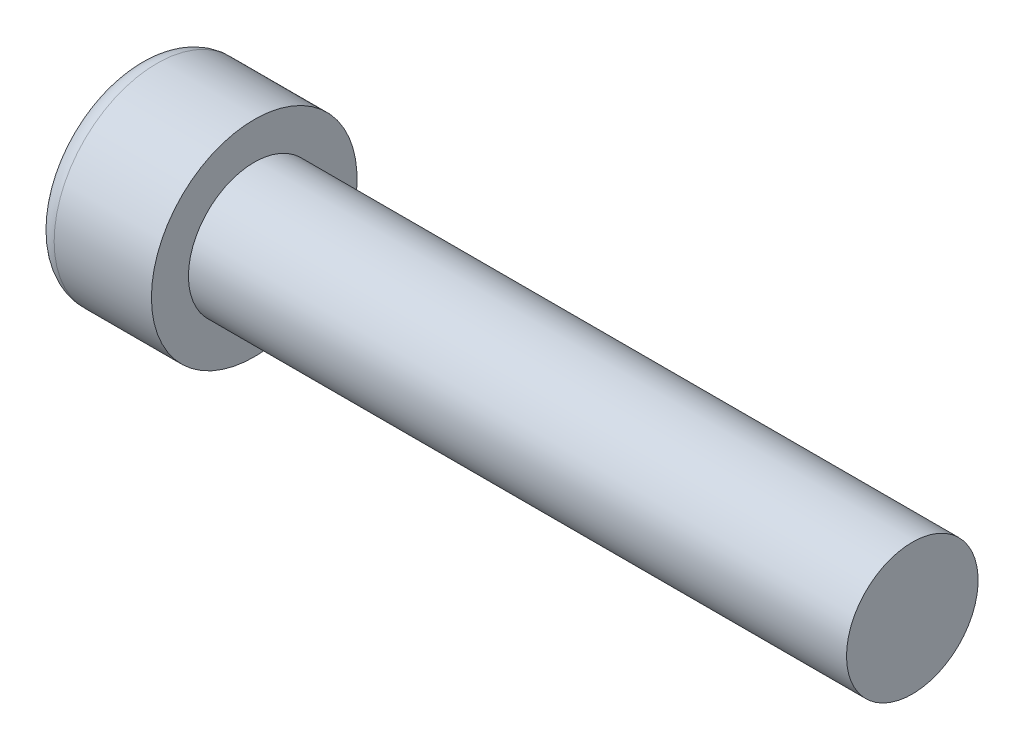
ISO-10303-21;
HEADER;
FILE_DESCRIPTION(('STEP AP214'),'2;1');
FILE_NAME('part.step','',(''),(''),'','','');
FILE_SCHEMA(('AUTOMOTIVE_DESIGN { 1 0 10303 214 1 1 1 1 }'));
ENDSEC;
DATA;
#1=APPLICATION_CONTEXT('core data for automotive mechanical design processes');
#2=APPLICATION_PROTOCOL_DEFINITION('international standard','automotive_design',2000,#1);
#3=PRODUCT_CONTEXT('',#1,'mechanical');
#4=PRODUCT('Part','Part','',(#3));
#5=PRODUCT_RELATED_PRODUCT_CATEGORY('part','',(#4));
#6=PRODUCT_DEFINITION_FORMATION('','',#4);
#7=PRODUCT_DEFINITION_CONTEXT('part definition',#1,'design');
#8=PRODUCT_DEFINITION('design','',#6,#7);
#9=PRODUCT_DEFINITION_SHAPE('','',#8);
#10=(LENGTH_UNIT() NAMED_UNIT(*) SI_UNIT(.MILLI.,.METRE.));
#11=(NAMED_UNIT(*) PLANE_ANGLE_UNIT() SI_UNIT($,.RADIAN.));
#12=(NAMED_UNIT(*) SI_UNIT($,.STERADIAN.) SOLID_ANGLE_UNIT());
#13=UNCERTAINTY_MEASURE_WITH_UNIT(LENGTH_MEASURE(1.E-05),#10,'distance_accuracy_value','');
#14=(GEOMETRIC_REPRESENTATION_CONTEXT(3) GLOBAL_UNCERTAINTY_ASSIGNED_CONTEXT((#13)) GLOBAL_UNIT_ASSIGNED_CONTEXT((#10,
#11,#12)) REPRESENTATION_CONTEXT('',''));
#15=CARTESIAN_POINT('',(0.,0.,0.));
#16=DIRECTION('',(0.,0.,1.));
#17=DIRECTION('',(1.,0.,0.));
#18=AXIS2_PLACEMENT_3D('',#15,#16,#17);
#19=CARTESIAN_POINT('',(3.2,0.,0.));
#20=DIRECTION('',(-1.,0.,0.));
#21=DIRECTION('',(0.,1.,0.));
#22=AXIS2_PLACEMENT_3D('',#19,#20,#21);
#23=SPHERICAL_SURFACE('',#22,3.2);
#24=CARTESIAN_POINT('',(0.192048521598005,0.,0.));
#25=DIRECTION('',(-1.,0.,0.));
#26=DIRECTION('',(0.,0.,1.));
#27=AXIS2_PLACEMENT_3D('',#24,#25,#26);
#28=CIRCLE('',#27,1.09189189189189);
#29=CARTESIAN_POINT('',(0.192048521598005,0.,1.09189189189189));
#30=VERTEX_POINT('',#29);
#31=EDGE_CURVE('E154',#30,#30,#28,.T.);
#32=ORIENTED_EDGE('',*,*,#31,.T.);
#33=EDGE_LOOP('',(#32));
#34=FACE_BOUND('',#33,.T.);
#35=CARTESIAN_POINT('',(3.19174554351625,-0.0818566934638239,0.));
#36=DIRECTION('',(-0.100331502261418,-0.994954064092392,0.));
#37=DIRECTION('',(0.994954064092392,-0.100331502261418,0.));
#38=AXIS2_PLACEMENT_3D('',#35,#36,#37);
#39=CIRCLE('',#38,3.1989422229361);
#40=CARTESIAN_POINT('',(0.118330716626357,0.228067490760365,0.83144431417242));
#41=VERTEX_POINT('',#40);
#42=CARTESIAN_POINT('',(0.0177814447975956,0.238206913129653,0.238206913129654));
#43=VERTEX_POINT('',#42);
#44=EDGE_CURVE('E185',#41,#43,#39,.T.);
#45=ORIENTED_EDGE('',*,*,#44,.F.);
#46=CARTESIAN_POINT('',(2.64043280070581,0.,-0.842892363493775));
#47=DIRECTION('',(0.553083521918191,0.,0.833125811497021));
#48=DIRECTION('',(0.833125811497021,0.,-0.553083521918191));
#49=AXIS2_PLACEMENT_3D('',#46,#47,#48);
#50=CIRCLE('',#49,3.03585523585001);
#51=CARTESIAN_POINT('',(0.118330716626356,-0.22806749076037,0.831444314172418));
#52=VERTEX_POINT('',#51);
#53=EDGE_CURVE('E150',#41,#52,#50,.T.);
#54=ORIENTED_EDGE('',*,*,#53,.T.);
#55=CARTESIAN_POINT('',(3.19174554351625,0.0818566934638237,0.));
#56=DIRECTION('',(-0.100331502261418,0.994954064092392,0.));
#57=DIRECTION('',(-0.994954064092392,-0.100331502261418,0.));
#58=AXIS2_PLACEMENT_3D('',#55,#56,#57);
#59=CIRCLE('',#58,3.1989422229361);
#60=CARTESIAN_POINT('',(0.0177814447975947,-0.238206913129655,0.238206913129654));
#61=VERTEX_POINT('',#60);
#62=EDGE_CURVE('E106',#61,#52,#59,.T.);
#63=ORIENTED_EDGE('',*,*,#62,.F.);
#64=CARTESIAN_POINT('',(3.19174554351625,0.,-0.0818566934638237));
#65=DIRECTION('',(-0.100331502261418,0.,-0.994954064092392));
#66=DIRECTION('',(-0.994954064092392,0.,0.100331502261418));
#67=AXIS2_PLACEMENT_3D('',#64,#65,#66);
#68=CIRCLE('',#67,3.1989422229361);
#69=CARTESIAN_POINT('',(0.118330716626357,-0.831444314172419,0.228067490760367));
#70=VERTEX_POINT('',#69);
#71=EDGE_CURVE('E131',#70,#61,#68,.T.);
#72=ORIENTED_EDGE('',*,*,#71,.F.);
#73=CARTESIAN_POINT('',(2.64043280070581,0.842892363493775,0.));
#74=DIRECTION('',(0.553083521918191,-0.833125811497021,0.));
#75=DIRECTION('',(0.833125811497021,0.553083521918191,0.));
#76=AXIS2_PLACEMENT_3D('',#73,#74,#75);
#77=CIRCLE('',#76,3.03585523585001);
#78=CARTESIAN_POINT('',(0.118330716626356,-0.831444314172419,-0.228067490760367));
#79=VERTEX_POINT('',#78);
#80=EDGE_CURVE('E139',#70,#79,#77,.T.);
#81=ORIENTED_EDGE('',*,*,#80,.T.);
#82=CARTESIAN_POINT('',(3.19174554351625,0.,0.0818566934638239));
#83=DIRECTION('',(-0.100331502261418,0.,0.994954064092392));
#84=DIRECTION('',(0.994954064092392,0.,0.100331502261418));
#85=AXIS2_PLACEMENT_3D('',#82,#83,#84);
#86=CIRCLE('',#85,3.1989422229361);
#87=CARTESIAN_POINT('',(0.0177814447975952,-0.238206913129653,-0.238206913129654));
#88=VERTEX_POINT('',#87);
#89=EDGE_CURVE('E49',#88,#79,#86,.T.);
#90=ORIENTED_EDGE('',*,*,#89,.F.);
#91=CARTESIAN_POINT('',(0.118330716626357,-0.228067490760364,-0.83144431417242));
#92=VERTEX_POINT('',#91);
#93=EDGE_CURVE('E192',#92,#88,#59,.T.);
#94=ORIENTED_EDGE('',*,*,#93,.F.);
#95=CARTESIAN_POINT('',(2.64043280070581,0.,0.842892363493775));
#96=DIRECTION('',(0.553083521918191,0.,-0.833125811497021));
#97=DIRECTION('',(-0.833125811497021,0.,-0.553083521918191));
#98=AXIS2_PLACEMENT_3D('',#95,#96,#97);
#99=CIRCLE('',#98,3.03585523585001);
#100=CARTESIAN_POINT('',(0.118330716626357,0.22806749076037,-0.831444314172418));
#101=VERTEX_POINT('',#100);
#102=EDGE_CURVE('E132',#92,#101,#99,.T.);
#103=ORIENTED_EDGE('',*,*,#102,.T.);
#104=CARTESIAN_POINT('',(0.0177814447975956,0.238206913129655,-0.238206913129654));
#105=VERTEX_POINT('',#104);
#106=EDGE_CURVE('E180',#105,#101,#39,.T.);
#107=ORIENTED_EDGE('',*,*,#106,.F.);
#108=CARTESIAN_POINT('',(0.118330716626356,0.831444314172419,-0.228067490760367));
#109=VERTEX_POINT('',#108);
#110=EDGE_CURVE('E42',#109,#105,#86,.T.);
#111=ORIENTED_EDGE('',*,*,#110,.F.);
#112=CARTESIAN_POINT('',(2.64043280070581,-0.842892363493776,0.));
#113=DIRECTION('',(0.553083521918191,0.833125811497021,0.));
#114=DIRECTION('',(-0.833125811497021,0.553083521918191,0.));
#115=AXIS2_PLACEMENT_3D('',#112,#113,#114);
#116=CIRCLE('',#115,3.03585523585001);
#117=CARTESIAN_POINT('',(0.118330716626357,0.831444314172419,0.228067490760367));
#118=VERTEX_POINT('',#117);
#119=EDGE_CURVE('E11',#109,#118,#116,.T.);
#120=ORIENTED_EDGE('',*,*,#119,.T.);
#121=EDGE_CURVE('E168',#43,#118,#68,.T.);
#122=ORIENTED_EDGE('',*,*,#121,.F.);
#123=EDGE_LOOP('',(#45,#54,#63,#72,#81,#90,#94,#103,#107,#111,#120,#122));
#124=FACE_BOUND('',#123,.T.);
#125=ADVANCED_FACE('F34',(#34,#124),#23,.T.);
#126=CARTESIAN_POINT('',(1.37075949367089,0.,-0.101772151898734));
#127=DIRECTION('',(-0.100331502261418,0.,0.994954064092392));
#128=DIRECTION('',(0.994954064092392,0.,0.100331502261418));
#129=AXIS2_PLACEMENT_3D('',#126,#127,#128);
#130=PLANE('',#129);
#131=ORIENTED_EDGE('',*,*,#110,.T.);
#132=DIRECTION('',(0.989983749746913,-0.0998302940921261,0.0998302940921257));
#133=VECTOR('',#132,1.);
#134=CARTESIAN_POINT('',(1.38081767298512,0.100757881715786,-0.100757881715786));
#135=LINE('',#134,#133);
#136=CARTESIAN_POINT('',(1.19,0.12,-0.12));
#137=VERTEX_POINT('',#136);
#138=EDGE_CURVE('E174',#105,#137,#135,.T.);
#139=ORIENTED_EDGE('',*,*,#138,.T.);
#140=DIRECTION('',(0.830201128729582,-0.551141925795269,0.083717760880294));
#141=VECTOR('',#140,1.);
#142=CARTESIAN_POINT('',(0.,0.91,-0.24));
#143=LINE('',#142,#141);
#144=EDGE_CURVE('E155',#109,#137,#143,.T.);
#145=ORIENTED_EDGE('',*,*,#144,.F.);
#146=EDGE_LOOP('',(#131,#139,#145));
#147=FACE_BOUND('',#146,.T.);
#148=ADVANCED_FACE('F173',(#147),#130,.T.);
#149=DIRECTION('',(0.830201128729582,0.551141925795269,0.083717760880294));
#150=VECTOR('',#149,1.);
#151=CARTESIAN_POINT('',(0.,-0.91,-0.24));
#152=LINE('',#151,#150);
#153=CARTESIAN_POINT('',(1.19,-0.12,-0.12));
#154=VERTEX_POINT('',#153);
#155=EDGE_CURVE('E140',#79,#154,#152,.T.);
#156=ORIENTED_EDGE('',*,*,#155,.T.);
#157=DIRECTION('',(-0.989983749746913,-0.0998302940921253,-0.0998302940921257));
#158=VECTOR('',#157,1.);
#159=CARTESIAN_POINT('',(1.38081767298512,-0.100757881715786,-0.100757881715786));
#160=LINE('',#159,#158);
#161=EDGE_CURVE('E195',#154,#88,#160,.T.);
#162=ORIENTED_EDGE('',*,*,#161,.T.);
#163=ORIENTED_EDGE('',*,*,#89,.T.);
#164=EDGE_LOOP('',(#156,#162,#163));
#165=FACE_BOUND('',#164,.T.);
#166=ADVANCED_FACE('F210',(#165),#130,.T.);
#167=CARTESIAN_POINT('',(1.37075949367089,0.,0.101772151898734));
#168=DIRECTION('',(-0.100331502261418,0.,-0.994954064092392));
#169=DIRECTION('',(-0.994954064092392,0.,0.100331502261418));
#170=AXIS2_PLACEMENT_3D('',#167,#168,#169);
#171=PLANE('',#170);
#172=DIRECTION('',(0.830201128729582,-0.551141925795269,-0.083717760880294));
#173=VECTOR('',#172,1.);
#174=CARTESIAN_POINT('',(0.,0.91,0.24));
#175=LINE('',#174,#173);
#176=CARTESIAN_POINT('',(1.19,0.12,0.12));
#177=VERTEX_POINT('',#176);
#178=EDGE_CURVE('E211',#118,#177,#175,.T.);
#179=ORIENTED_EDGE('',*,*,#178,.T.);
#180=DIRECTION('',(-0.989983749746913,0.0998302940921254,0.0998302940921256));
#181=VECTOR('',#180,1.);
#182=CARTESIAN_POINT('',(1.38081767298512,0.100757881715786,0.100757881715786));
#183=LINE('',#182,#181);
#184=EDGE_CURVE('E189',#177,#43,#183,.T.);
#185=ORIENTED_EDGE('',*,*,#184,.T.);
#186=ORIENTED_EDGE('',*,*,#121,.T.);
#187=EDGE_LOOP('',(#179,#185,#186));
#188=FACE_BOUND('',#187,.T.);
#189=ADVANCED_FACE('F215',(#188),#171,.T.);
#190=ORIENTED_EDGE('',*,*,#71,.T.);
#191=DIRECTION('',(0.989983749746913,0.099830294092126,-0.0998302940921256));
#192=VECTOR('',#191,1.);
#193=CARTESIAN_POINT('',(1.38081767298512,-0.100757881715786,0.100757881715786));
#194=LINE('',#193,#192);
#195=CARTESIAN_POINT('',(1.19,-0.12,0.12));
#196=VERTEX_POINT('',#195);
#197=EDGE_CURVE('E104',#61,#196,#194,.T.);
#198=ORIENTED_EDGE('',*,*,#197,.T.);
#199=DIRECTION('',(0.830201128729582,0.551141925795269,-0.0837177608802938));
#200=VECTOR('',#199,1.);
#201=CARTESIAN_POINT('',(0.,-0.91,0.24));
#202=LINE('',#201,#200);
#203=EDGE_CURVE('E129',#70,#196,#202,.T.);
#204=ORIENTED_EDGE('',*,*,#203,.F.);
#205=EDGE_LOOP('',(#190,#198,#204));
#206=FACE_BOUND('',#205,.T.);
#207=ADVANCED_FACE('F128',(#206),#171,.T.);
#208=CARTESIAN_POINT('',(-25.4,0.,0.));
#209=DIRECTION('',(-1.,0.,0.));
#210=DIRECTION('',(0.,0.,1.));
#211=AXIS2_PLACEMENT_3D('',#208,#209,#210);
#212=CYLINDRICAL_SURFACE('',#211,0.8);
#213=CARTESIAN_POINT('',(9.6,0.,0.));
#214=DIRECTION('',(-1.,0.,0.));
#215=DIRECTION('',(0.,0.,1.));
#216=AXIS2_PLACEMENT_3D('',#213,#214,#215);
#217=CIRCLE('',#216,0.8);
#218=CARTESIAN_POINT('',(9.6,0.,0.8));
#219=VERTEX_POINT('',#218);
#220=EDGE_CURVE('E151',#219,#219,#217,.T.);
#221=ORIENTED_EDGE('',*,*,#220,.T.);
#222=EDGE_LOOP('',(#221));
#223=FACE_BOUND('',#222,.T.);
#224=CARTESIAN_POINT('',(1.6,0.,0.));
#225=DIRECTION('',(-1.,0.,0.));
#226=DIRECTION('',(0.,0.,1.));
#227=AXIS2_PLACEMENT_3D('',#224,#225,#226);
#228=CIRCLE('',#227,0.8);
#229=CARTESIAN_POINT('',(1.6,0.,0.8));
#230=VERTEX_POINT('',#229);
#231=EDGE_CURVE('E164',#230,#230,#228,.T.);
#232=ORIENTED_EDGE('',*,*,#231,.F.);
#233=EDGE_LOOP('',(#232));
#234=FACE_BOUND('',#233,.T.);
#235=ADVANCED_FACE('F36',(#223,#234),#212,.T.);
#236=CARTESIAN_POINT('',(1.6,0.8,0.));
#237=DIRECTION('',(-1.,0.,0.));
#238=DIRECTION('',(0.,0.,1.));
#239=AXIS2_PLACEMENT_3D('',#236,#237,#238);
#240=PLANE('',#239);
#241=CARTESIAN_POINT('',(1.6,0.,0.));
#242=DIRECTION('',(-1.,0.,0.));
#243=DIRECTION('',(0.,0.,1.));
#244=AXIS2_PLACEMENT_3D('',#241,#242,#243);
#245=CIRCLE('',#244,1.25);
#246=CARTESIAN_POINT('',(1.6,0.,1.25));
#247=VERTEX_POINT('',#246);
#248=EDGE_CURVE('E161',#247,#247,#245,.T.);
#249=ORIENTED_EDGE('',*,*,#248,.F.);
#250=EDGE_LOOP('',(#249));
#251=FACE_BOUND('',#250,.T.);
#252=ORIENTED_EDGE('',*,*,#231,.T.);
#253=EDGE_LOOP('',(#252));
#254=FACE_BOUND('',#253,.T.);
#255=ADVANCED_FACE('F243',(#251,#254),#240,.F.);
#256=CARTESIAN_POINT('',(-25.4,0.,0.));
#257=DIRECTION('',(-1.,0.,0.));
#258=DIRECTION('',(0.,0.,1.));
#259=AXIS2_PLACEMENT_3D('',#256,#257,#258);
#260=CYLINDRICAL_SURFACE('',#259,1.25);
#261=ORIENTED_EDGE('',*,*,#248,.T.);
#262=EDGE_LOOP('',(#261));
#263=FACE_BOUND('',#262,.T.);
#264=CARTESIAN_POINT('',(0.417644882478155,0.,0.));
#265=DIRECTION('',(-1.,0.,0.));
#266=DIRECTION('',(0.,0.,1.));
#267=AXIS2_PLACEMENT_3D('',#264,#265,#266);
#268=CIRCLE('',#267,1.25);
#269=CARTESIAN_POINT('',(0.417644882478155,0.,1.25));
#270=VERTEX_POINT('',#269);
#271=EDGE_CURVE('E158',#270,#270,#268,.T.);
#272=ORIENTED_EDGE('',*,*,#271,.F.);
#273=EDGE_LOOP('',(#272));
#274=FACE_BOUND('',#273,.T.);
#275=ADVANCED_FACE('F240',(#263,#274),#260,.T.);
#276=CARTESIAN_POINT('',(0.417644882478155,0.,0.));
#277=DIRECTION('',(-1.,0.,0.));
#278=DIRECTION('',(0.,0.,1.));
#279=AXIS2_PLACEMENT_3D('',#276,#277,#278);
#280=TOROIDAL_SURFACE('',#279,1.01,0.24);
#281=ORIENTED_EDGE('',*,*,#271,.T.);
#282=EDGE_LOOP('',(#281));
#283=FACE_BOUND('',#282,.T.);
#284=ORIENTED_EDGE('',*,*,#31,.F.);
#285=EDGE_LOOP('',(#284));
#286=FACE_BOUND('',#285,.T.);
#287=ADVANCED_FACE('F237',(#283,#286),#280,.T.);
#288=CARTESIAN_POINT('',(9.6,0.8,0.));
#289=DIRECTION('',(1.,0.,0.));
#290=DIRECTION('',(0.,0.,-1.));
#291=AXIS2_PLACEMENT_3D('',#288,#289,#290);
#292=PLANE('',#291);
#293=ORIENTED_EDGE('',*,*,#220,.F.);
#294=EDGE_LOOP('',(#293));
#295=FACE_BOUND('',#294,.T.);
#296=ADVANCED_FACE('F235',(#295),#292,.T.);
#297=CARTESIAN_POINT('',(1.19,0.12,0.12));
#298=DIRECTION('',(0.553083521918191,0.833125811497021,0.));
#299=DIRECTION('',(-0.833125811497021,0.553083521918191,0.));
#300=AXIS2_PLACEMENT_3D('',#297,#298,#299);
#301=PLANE('',#300);
#302=ORIENTED_EDGE('',*,*,#144,.T.);
#303=DIRECTION('',(0.,0.,-1.));
#304=VECTOR('',#303,1.);
#305=CARTESIAN_POINT('',(1.19,0.12,0.12));
#306=LINE('',#305,#304);
#307=EDGE_CURVE('E122',#177,#137,#306,.T.);
#308=ORIENTED_EDGE('',*,*,#307,.F.);
#309=ORIENTED_EDGE('',*,*,#178,.F.);
#310=ORIENTED_EDGE('',*,*,#119,.F.);
#311=EDGE_LOOP('',(#302,#308,#309,#310));
#312=FACE_BOUND('',#311,.T.);
#313=ADVANCED_FACE('F214',(#312),#301,.F.);
#314=CARTESIAN_POINT('',(0.,-0.91,-0.24));
#315=DIRECTION('',(0.553083521918191,-0.833125811497021,0.));
#316=DIRECTION('',(0.833125811497021,0.553083521918191,0.));
#317=AXIS2_PLACEMENT_3D('',#314,#315,#316);
#318=PLANE('',#317);
#319=ORIENTED_EDGE('',*,*,#203,.T.);
#320=DIRECTION('',(0.,0.,1.));
#321=VECTOR('',#320,1.);
#322=CARTESIAN_POINT('',(1.19,-0.12,-0.12));
#323=LINE('',#322,#321);
#324=EDGE_CURVE('E121',#154,#196,#323,.T.);
#325=ORIENTED_EDGE('',*,*,#324,.F.);
#326=ORIENTED_EDGE('',*,*,#155,.F.);
#327=ORIENTED_EDGE('',*,*,#80,.F.);
#328=EDGE_LOOP('',(#319,#325,#326,#327));
#329=FACE_BOUND('',#328,.T.);
#330=ADVANCED_FACE('F136',(#329),#318,.F.);
#331=CARTESIAN_POINT('',(1.19,0.12,-0.12));
#332=DIRECTION('',(-1.,0.,0.));
#333=DIRECTION('',(0.,0.,1.));
#334=AXIS2_PLACEMENT_3D('',#331,#332,#333);
#335=PLANE('',#334);
#336=DIRECTION('',(0.,1.,0.));
#337=VECTOR('',#336,1.);
#338=CARTESIAN_POINT('',(1.19,-0.12,-0.12));
#339=LINE('',#338,#337);
#340=EDGE_CURVE('E144',#154,#137,#339,.T.);
#341=ORIENTED_EDGE('',*,*,#340,.F.);
#342=ORIENTED_EDGE('',*,*,#324,.T.);
#343=DIRECTION('',(0.,-1.,0.));
#344=VECTOR('',#343,1.);
#345=CARTESIAN_POINT('',(1.19,0.12,0.12));
#346=LINE('',#345,#344);
#347=EDGE_CURVE('E113',#177,#196,#346,.T.);
#348=ORIENTED_EDGE('',*,*,#347,.F.);
#349=ORIENTED_EDGE('',*,*,#307,.T.);
#350=EDGE_LOOP('',(#341,#342,#348,#349));
#351=FACE_BOUND('',#350,.T.);
#352=ADVANCED_FACE('F142',(#351),#335,.T.);
#353=CARTESIAN_POINT('',(0.,0.240000000000003,-0.909999999999999));
#354=DIRECTION('',(0.553083521918191,0.,-0.833125811497021));
#355=DIRECTION('',(0.833125811497021,0.,0.553083521918191));
#356=AXIS2_PLACEMENT_3D('',#353,#354,#355);
#357=PLANE('',#356);
#358=DIRECTION('',(0.830201128729582,0.0837177608802919,0.551141925795269));
#359=VECTOR('',#358,1.);
#360=CARTESIAN_POINT('',(0.,-0.239999999999997,-0.910000000000001));
#361=LINE('',#360,#359);
#362=EDGE_CURVE('E200',#92,#154,#361,.T.);
#363=ORIENTED_EDGE('',*,*,#362,.T.);
#364=ORIENTED_EDGE('',*,*,#340,.T.);
#365=DIRECTION('',(0.830201128729582,-0.0837177608802959,0.551141925795269));
#366=VECTOR('',#365,1.);
#367=CARTESIAN_POINT('',(0.,0.240000000000003,-0.909999999999999));
#368=LINE('',#367,#366);
#369=EDGE_CURVE('E110',#101,#137,#368,.T.);
#370=ORIENTED_EDGE('',*,*,#369,.F.);
#371=ORIENTED_EDGE('',*,*,#102,.F.);
#372=EDGE_LOOP('',(#363,#364,#370,#371));
#373=FACE_BOUND('',#372,.T.);
#374=ADVANCED_FACE('F205',(#373),#357,.F.);
#375=CARTESIAN_POINT('',(1.37075949367089,-0.101772151898734,0.));
#376=DIRECTION('',(-0.100331502261418,0.994954064092392,0.));
#377=DIRECTION('',(-0.994954064092392,-0.100331502261418,0.));
#378=AXIS2_PLACEMENT_3D('',#375,#376,#377);
#379=PLANE('',#378);
#380=ORIENTED_EDGE('',*,*,#93,.T.);
#381=ORIENTED_EDGE('',*,*,#161,.F.);
#382=ORIENTED_EDGE('',*,*,#362,.F.);
#383=EDGE_LOOP('',(#380,#381,#382));
#384=FACE_BOUND('',#383,.T.);
#385=ADVANCED_FACE('F209',(#384),#379,.T.);
#386=CARTESIAN_POINT('',(1.37075949367089,0.101772151898734,0.));
#387=DIRECTION('',(-0.100331502261418,-0.994954064092392,0.));
#388=DIRECTION('',(0.994954064092392,-0.100331502261418,0.));
#389=AXIS2_PLACEMENT_3D('',#386,#387,#388);
#390=PLANE('',#389);
#391=ORIENTED_EDGE('',*,*,#106,.T.);
#392=ORIENTED_EDGE('',*,*,#369,.T.);
#393=ORIENTED_EDGE('',*,*,#138,.F.);
#394=EDGE_LOOP('',(#391,#392,#393));
#395=FACE_BOUND('',#394,.T.);
#396=ADVANCED_FACE('F203',(#395),#390,.T.);
#397=CARTESIAN_POINT('',(1.19,-0.12,0.12));
#398=DIRECTION('',(0.553083521918191,0.,0.833125811497021));
#399=DIRECTION('',(-0.833125811497021,0.,0.553083521918191));
#400=AXIS2_PLACEMENT_3D('',#397,#398,#399);
#401=PLANE('',#400);
#402=DIRECTION('',(0.830201128729582,-0.0837177608802921,-0.551141925795269));
#403=VECTOR('',#402,1.);
#404=CARTESIAN_POINT('',(0.,0.239999999999997,0.910000000000001));
#405=LINE('',#404,#403);
#406=EDGE_CURVE('E109',#41,#177,#405,.T.);
#407=ORIENTED_EDGE('',*,*,#406,.T.);
#408=ORIENTED_EDGE('',*,*,#347,.T.);
#409=DIRECTION('',(0.830201128729582,0.0837177608802959,-0.551141925795269));
#410=VECTOR('',#409,1.);
#411=CARTESIAN_POINT('',(0.,-0.240000000000003,0.909999999999999));
#412=LINE('',#411,#410);
#413=EDGE_CURVE('E100',#52,#196,#412,.T.);
#414=ORIENTED_EDGE('',*,*,#413,.F.);
#415=ORIENTED_EDGE('',*,*,#53,.F.);
#416=EDGE_LOOP('',(#407,#408,#414,#415));
#417=FACE_BOUND('',#416,.T.);
#418=ADVANCED_FACE('F114',(#417),#401,.F.);
#419=ORIENTED_EDGE('',*,*,#44,.T.);
#420=ORIENTED_EDGE('',*,*,#184,.F.);
#421=ORIENTED_EDGE('',*,*,#406,.F.);
#422=EDGE_LOOP('',(#419,#420,#421));
#423=FACE_BOUND('',#422,.T.);
#424=ADVANCED_FACE('F216',(#423),#390,.T.);
#425=ORIENTED_EDGE('',*,*,#62,.T.);
#426=ORIENTED_EDGE('',*,*,#413,.T.);
#427=ORIENTED_EDGE('',*,*,#197,.F.);
#428=EDGE_LOOP('',(#425,#426,#427));
#429=FACE_BOUND('',#428,.T.);
#430=ADVANCED_FACE('F102',(#429),#379,.T.);
#431=CLOSED_SHELL('',(#125,#148,#166,#189,#207,#235,#255,#275,#287,#296,#313,#330,#352,#374,
#385,#396,#418,#424,#430));
#432=MANIFOLD_SOLID_BREP('B2',#431);
#433=ADVANCED_BREP_SHAPE_REPRESENTATION('',(#18,#432),#14);
#434=SHAPE_DEFINITION_REPRESENTATION(#9,#433);
ENDSEC;
END-ISO-10303-21;
